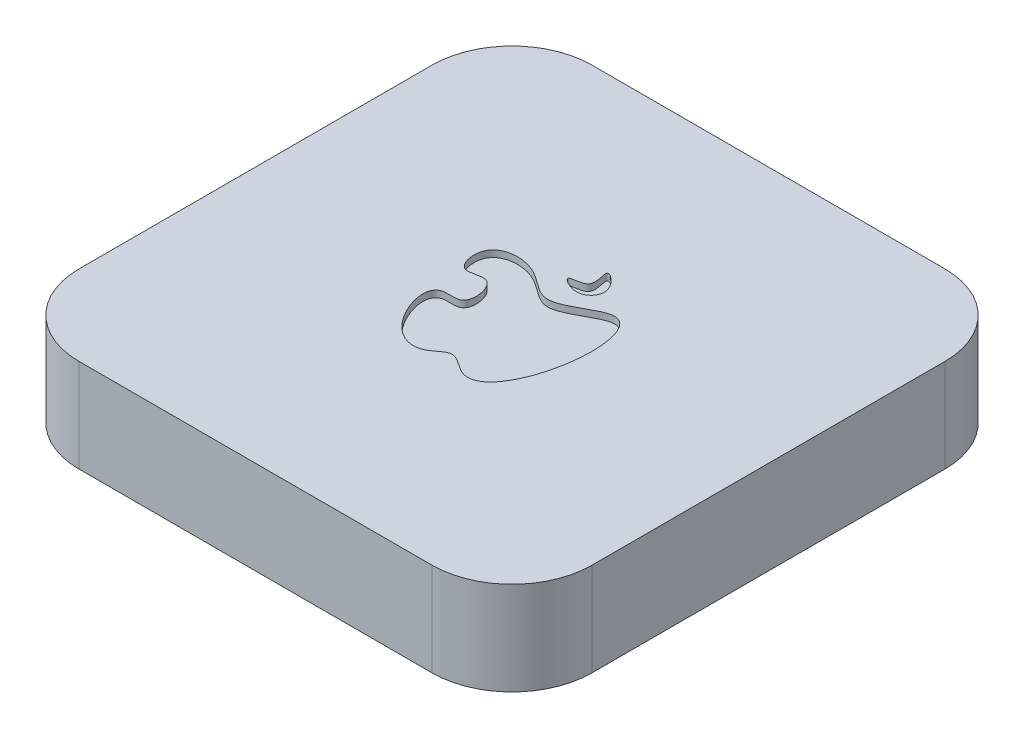
ISO-10303-21;
HEADER;
FILE_DESCRIPTION(('STEP AP214'),'2;1');
FILE_NAME('part.step','',(''),(''),'','','');
FILE_SCHEMA(('AUTOMOTIVE_DESIGN { 1 0 10303 214 1 1 1 1 }'));
ENDSEC;
DATA;
#1=APPLICATION_CONTEXT('core data for automotive mechanical design processes');
#2=APPLICATION_PROTOCOL_DEFINITION('international standard','automotive_design',2000,#1);
#3=PRODUCT_CONTEXT('',#1,'mechanical');
#4=PRODUCT('Part','Part','',(#3));
#5=PRODUCT_RELATED_PRODUCT_CATEGORY('part','',(#4));
#6=PRODUCT_DEFINITION_FORMATION('','',#4);
#7=PRODUCT_DEFINITION_CONTEXT('part definition',#1,'design');
#8=PRODUCT_DEFINITION('design','',#6,#7);
#9=PRODUCT_DEFINITION_SHAPE('','',#8);
#10=(LENGTH_UNIT() NAMED_UNIT(*) SI_UNIT(.MILLI.,.METRE.));
#11=(NAMED_UNIT(*) PLANE_ANGLE_UNIT() SI_UNIT($,.RADIAN.));
#12=(NAMED_UNIT(*) SI_UNIT($,.STERADIAN.) SOLID_ANGLE_UNIT());
#13=UNCERTAINTY_MEASURE_WITH_UNIT(LENGTH_MEASURE(1.E-05),#10,'distance_accuracy_value','');
#14=(GEOMETRIC_REPRESENTATION_CONTEXT(3) GLOBAL_UNCERTAINTY_ASSIGNED_CONTEXT((#13)) GLOBAL_UNIT_ASSIGNED_CONTEXT((#10,
#11,#12)) REPRESENTATION_CONTEXT('',''));
#15=CARTESIAN_POINT('',(0.,0.,0.));
#16=DIRECTION('',(0.,0.,1.));
#17=DIRECTION('',(1.,0.,0.));
#18=AXIS2_PLACEMENT_3D('',#15,#16,#17);
#19=CARTESIAN_POINT('',(67.31,35.56,-67.31));
#20=DIRECTION('',(0.,-1.,0.));
#21=DIRECTION('',(0.,0.,-1.));
#22=AXIS2_PLACEMENT_3D('',#19,#20,#21);
#23=CYLINDRICAL_SURFACE('',#22,30.48);
#24=CARTESIAN_POINT('',(67.31,0.,-67.31));
#25=DIRECTION('',(0.,1.,0.));
#26=DIRECTION('',(0.,0.,-1.));
#27=AXIS2_PLACEMENT_3D('',#24,#25,#26);
#28=CIRCLE('',#27,30.48);
#29=CARTESIAN_POINT('',(97.79,0.,-67.31));
#30=VERTEX_POINT('',#29);
#31=CARTESIAN_POINT('',(67.31,0.,-97.79));
#32=VERTEX_POINT('',#31);
#33=EDGE_CURVE('E128',#30,#32,#28,.T.);
#34=ORIENTED_EDGE('',*,*,#33,.T.);
#35=DIRECTION('',(0.,-1.,0.));
#36=VECTOR('',#35,1.);
#37=CARTESIAN_POINT('',(67.31,35.56,-97.79));
#38=LINE('',#37,#36);
#39=CARTESIAN_POINT('',(67.31,35.56,-97.79));
#40=VERTEX_POINT('',#39);
#41=EDGE_CURVE('E11',#40,#32,#38,.T.);
#42=ORIENTED_EDGE('',*,*,#41,.F.);
#43=CARTESIAN_POINT('',(67.31,35.56,-67.31));
#44=DIRECTION('',(0.,1.,0.));
#45=DIRECTION('',(0.,0.,-1.));
#46=AXIS2_PLACEMENT_3D('',#43,#44,#45);
#47=CIRCLE('',#46,30.48);
#48=CARTESIAN_POINT('',(97.79,35.56,-67.31));
#49=VERTEX_POINT('',#48);
#50=EDGE_CURVE('E143',#49,#40,#47,.T.);
#51=ORIENTED_EDGE('',*,*,#50,.F.);
#52=DIRECTION('',(0.,-1.,0.));
#53=VECTOR('',#52,1.);
#54=CARTESIAN_POINT('',(97.79,35.56,-67.31));
#55=LINE('',#54,#53);
#56=EDGE_CURVE('E124',#49,#30,#55,.T.);
#57=ORIENTED_EDGE('',*,*,#56,.T.);
#58=EDGE_LOOP('',(#34,#42,#51,#57));
#59=FACE_BOUND('',#58,.T.);
#60=ADVANCED_FACE('F32',(#59),#23,.T.);
#61=CARTESIAN_POINT('',(-67.31,35.56,-97.79));
#62=DIRECTION('',(0.,0.,1.));
#63=DIRECTION('',(1.,0.,0.));
#64=AXIS2_PLACEMENT_3D('',#61,#62,#63);
#65=PLANE('',#64);
#66=DIRECTION('',(-1.,0.,0.));
#67=VECTOR('',#66,1.);
#68=CARTESIAN_POINT('',(-67.31,0.,-97.79));
#69=LINE('',#68,#67);
#70=CARTESIAN_POINT('',(-67.31,0.,-97.79));
#71=VERTEX_POINT('',#70);
#72=EDGE_CURVE('E131',#32,#71,#69,.T.);
#73=ORIENTED_EDGE('',*,*,#72,.T.);
#74=DIRECTION('',(0.,-1.,0.));
#75=VECTOR('',#74,1.);
#76=CARTESIAN_POINT('',(-67.31,35.56,-97.79));
#77=LINE('',#76,#75);
#78=CARTESIAN_POINT('',(-67.31,35.56,-97.79));
#79=VERTEX_POINT('',#78);
#80=EDGE_CURVE('E40',#79,#71,#77,.T.);
#81=ORIENTED_EDGE('',*,*,#80,.F.);
#82=DIRECTION('',(-1.,0.,0.));
#83=VECTOR('',#82,1.);
#84=CARTESIAN_POINT('',(-67.31,35.56,-97.79));
#85=LINE('',#84,#83);
#86=EDGE_CURVE('E91',#40,#79,#85,.T.);
#87=ORIENTED_EDGE('',*,*,#86,.F.);
#88=ORIENTED_EDGE('',*,*,#41,.T.);
#89=EDGE_LOOP('',(#73,#81,#87,#88));
#90=FACE_BOUND('',#89,.T.);
#91=ADVANCED_FACE('F222',(#90),#65,.F.);
#92=CARTESIAN_POINT('',(-67.31,35.56,-67.31));
#93=DIRECTION('',(0.,-1.,0.));
#94=DIRECTION('',(0.,0.,-1.));
#95=AXIS2_PLACEMENT_3D('',#92,#93,#94);
#96=CYLINDRICAL_SURFACE('',#95,30.48);
#97=CARTESIAN_POINT('',(-67.31,0.,-67.31));
#98=DIRECTION('',(0.,1.,0.));
#99=DIRECTION('',(0.,0.,-1.));
#100=AXIS2_PLACEMENT_3D('',#97,#98,#99);
#101=CIRCLE('',#100,30.48);
#102=CARTESIAN_POINT('',(-97.79,0.,-67.31));
#103=VERTEX_POINT('',#102);
#104=EDGE_CURVE('E134',#71,#103,#101,.T.);
#105=ORIENTED_EDGE('',*,*,#104,.T.);
#106=DIRECTION('',(0.,-1.,0.));
#107=VECTOR('',#106,1.);
#108=CARTESIAN_POINT('',(-97.79,35.56,-67.31));
#109=LINE('',#108,#107);
#110=CARTESIAN_POINT('',(-97.79,35.56,-67.31));
#111=VERTEX_POINT('',#110);
#112=EDGE_CURVE('E150',#111,#103,#109,.T.);
#113=ORIENTED_EDGE('',*,*,#112,.F.);
#114=CARTESIAN_POINT('',(-67.31,35.56,-67.31));
#115=DIRECTION('',(0.,1.,0.));
#116=DIRECTION('',(0.,0.,-1.));
#117=AXIS2_PLACEMENT_3D('',#114,#115,#116);
#118=CIRCLE('',#117,30.48);
#119=EDGE_CURVE('E158',#79,#111,#118,.T.);
#120=ORIENTED_EDGE('',*,*,#119,.F.);
#121=ORIENTED_EDGE('',*,*,#80,.T.);
#122=EDGE_LOOP('',(#105,#113,#120,#121));
#123=FACE_BOUND('',#122,.T.);
#124=ADVANCED_FACE('F156',(#123),#96,.T.);
#125=CARTESIAN_POINT('',(-97.79,35.56,67.31));
#126=DIRECTION('',(1.,0.,0.));
#127=DIRECTION('',(0.,0.,-1.));
#128=AXIS2_PLACEMENT_3D('',#125,#126,#127);
#129=PLANE('',#128);
#130=DIRECTION('',(0.,0.,1.));
#131=VECTOR('',#130,1.);
#132=CARTESIAN_POINT('',(-97.79,0.,67.31));
#133=LINE('',#132,#131);
#134=CARTESIAN_POINT('',(-97.79,0.,67.31));
#135=VERTEX_POINT('',#134);
#136=EDGE_CURVE('E136',#103,#135,#133,.T.);
#137=ORIENTED_EDGE('',*,*,#136,.T.);
#138=DIRECTION('',(0.,-1.,0.));
#139=VECTOR('',#138,1.);
#140=CARTESIAN_POINT('',(-97.79,35.56,67.31));
#141=LINE('',#140,#139);
#142=CARTESIAN_POINT('',(-97.79,35.56,67.31));
#143=VERTEX_POINT('',#142);
#144=EDGE_CURVE('E147',#143,#135,#141,.T.);
#145=ORIENTED_EDGE('',*,*,#144,.F.);
#146=DIRECTION('',(0.,0.,1.));
#147=VECTOR('',#146,1.);
#148=CARTESIAN_POINT('',(-97.79,35.56,67.31));
#149=LINE('',#148,#147);
#150=EDGE_CURVE('E170',#111,#143,#149,.T.);
#151=ORIENTED_EDGE('',*,*,#150,.F.);
#152=ORIENTED_EDGE('',*,*,#112,.T.);
#153=EDGE_LOOP('',(#137,#145,#151,#152));
#154=FACE_BOUND('',#153,.T.);
#155=ADVANCED_FACE('F166',(#154),#129,.F.);
#156=CARTESIAN_POINT('',(-67.31,35.56,67.31));
#157=DIRECTION('',(0.,-1.,0.));
#158=DIRECTION('',(0.,0.,-1.));
#159=AXIS2_PLACEMENT_3D('',#156,#157,#158);
#160=CYLINDRICAL_SURFACE('',#159,30.48);
#161=CARTESIAN_POINT('',(-67.31,0.,67.31));
#162=DIRECTION('',(0.,1.,0.));
#163=DIRECTION('',(0.,0.,-1.));
#164=AXIS2_PLACEMENT_3D('',#161,#162,#163);
#165=CIRCLE('',#164,30.48);
#166=CARTESIAN_POINT('',(-67.31,0.,97.79));
#167=VERTEX_POINT('',#166);
#168=EDGE_CURVE('E138',#135,#167,#165,.T.);
#169=ORIENTED_EDGE('',*,*,#168,.T.);
#170=DIRECTION('',(0.,-1.,0.));
#171=VECTOR('',#170,1.);
#172=CARTESIAN_POINT('',(-67.31,35.56,97.79));
#173=LINE('',#172,#171);
#174=CARTESIAN_POINT('',(-67.31,35.56,97.79));
#175=VERTEX_POINT('',#174);
#176=EDGE_CURVE('E119',#175,#167,#173,.T.);
#177=ORIENTED_EDGE('',*,*,#176,.F.);
#178=CARTESIAN_POINT('',(-67.31,35.56,67.31));
#179=DIRECTION('',(0.,1.,0.));
#180=DIRECTION('',(0.,0.,-1.));
#181=AXIS2_PLACEMENT_3D('',#178,#179,#180);
#182=CIRCLE('',#181,30.48);
#183=EDGE_CURVE('E110',#143,#175,#182,.T.);
#184=ORIENTED_EDGE('',*,*,#183,.F.);
#185=ORIENTED_EDGE('',*,*,#144,.T.);
#186=EDGE_LOOP('',(#169,#177,#184,#185));
#187=FACE_BOUND('',#186,.T.);
#188=ADVANCED_FACE('F169',(#187),#160,.T.);
#189=CARTESIAN_POINT('',(-67.31,35.56,97.79));
#190=DIRECTION('',(0.,0.,-1.));
#191=DIRECTION('',(-1.,0.,0.));
#192=AXIS2_PLACEMENT_3D('',#189,#190,#191);
#193=PLANE('',#192);
#194=DIRECTION('',(1.,0.,0.));
#195=VECTOR('',#194,1.);
#196=CARTESIAN_POINT('',(-67.31,0.,97.79));
#197=LINE('',#196,#195);
#198=CARTESIAN_POINT('',(67.31,0.,97.79));
#199=VERTEX_POINT('',#198);
#200=EDGE_CURVE('E118',#167,#199,#197,.T.);
#201=ORIENTED_EDGE('',*,*,#200,.T.);
#202=DIRECTION('',(0.,-1.,0.));
#203=VECTOR('',#202,1.);
#204=CARTESIAN_POINT('',(67.31,35.56,97.79));
#205=LINE('',#204,#203);
#206=CARTESIAN_POINT('',(67.31,35.56,97.79));
#207=VERTEX_POINT('',#206);
#208=EDGE_CURVE('E115',#207,#199,#205,.T.);
#209=ORIENTED_EDGE('',*,*,#208,.F.);
#210=DIRECTION('',(1.,0.,0.));
#211=VECTOR('',#210,1.);
#212=CARTESIAN_POINT('',(-67.31,35.56,97.79));
#213=LINE('',#212,#211);
#214=EDGE_CURVE('E104',#175,#207,#213,.T.);
#215=ORIENTED_EDGE('',*,*,#214,.F.);
#216=ORIENTED_EDGE('',*,*,#176,.T.);
#217=EDGE_LOOP('',(#201,#209,#215,#216));
#218=FACE_BOUND('',#217,.T.);
#219=ADVANCED_FACE('F116',(#218),#193,.F.);
#220=CARTESIAN_POINT('',(67.31,35.56,67.31));
#221=DIRECTION('',(0.,-1.,0.));
#222=DIRECTION('',(0.,0.,-1.));
#223=AXIS2_PLACEMENT_3D('',#220,#221,#222);
#224=CYLINDRICAL_SURFACE('',#223,30.48);
#225=CARTESIAN_POINT('',(67.31,0.,67.31));
#226=DIRECTION('',(0.,1.,0.));
#227=DIRECTION('',(0.,0.,-1.));
#228=AXIS2_PLACEMENT_3D('',#225,#226,#227);
#229=CIRCLE('',#228,30.48);
#230=CARTESIAN_POINT('',(97.79,0.,67.31));
#231=VERTEX_POINT('',#230);
#232=EDGE_CURVE('E77',#199,#231,#229,.T.);
#233=ORIENTED_EDGE('',*,*,#232,.T.);
#234=DIRECTION('',(0.,-1.,0.));
#235=VECTOR('',#234,1.);
#236=CARTESIAN_POINT('',(97.79,35.56,67.31));
#237=LINE('',#236,#235);
#238=CARTESIAN_POINT('',(97.79,35.56,67.31));
#239=VERTEX_POINT('',#238);
#240=EDGE_CURVE('E120',#239,#231,#237,.T.);
#241=ORIENTED_EDGE('',*,*,#240,.F.);
#242=CARTESIAN_POINT('',(67.31,35.56,67.31));
#243=DIRECTION('',(0.,1.,0.));
#244=DIRECTION('',(0.,0.,-1.));
#245=AXIS2_PLACEMENT_3D('',#242,#243,#244);
#246=CIRCLE('',#245,30.48);
#247=EDGE_CURVE('E108',#207,#239,#246,.T.);
#248=ORIENTED_EDGE('',*,*,#247,.F.);
#249=ORIENTED_EDGE('',*,*,#208,.T.);
#250=EDGE_LOOP('',(#233,#241,#248,#249));
#251=FACE_BOUND('',#250,.T.);
#252=ADVANCED_FACE('F122',(#251),#224,.T.);
#253=CARTESIAN_POINT('',(97.79,35.56,67.31));
#254=DIRECTION('',(-1.,0.,0.));
#255=DIRECTION('',(0.,0.,1.));
#256=AXIS2_PLACEMENT_3D('',#253,#254,#255);
#257=PLANE('',#256);
#258=DIRECTION('',(0.,0.,-1.));
#259=VECTOR('',#258,1.);
#260=CARTESIAN_POINT('',(97.79,0.,67.31));
#261=LINE('',#260,#259);
#262=EDGE_CURVE('E83',#231,#30,#261,.T.);
#263=ORIENTED_EDGE('',*,*,#262,.T.);
#264=ORIENTED_EDGE('',*,*,#56,.F.);
#265=DIRECTION('',(0.,0.,-1.));
#266=VECTOR('',#265,1.);
#267=CARTESIAN_POINT('',(97.79,35.56,67.31));
#268=LINE('',#267,#266);
#269=EDGE_CURVE('E48',#239,#49,#268,.T.);
#270=ORIENTED_EDGE('',*,*,#269,.F.);
#271=ORIENTED_EDGE('',*,*,#240,.T.);
#272=EDGE_LOOP('',(#263,#264,#270,#271));
#273=FACE_BOUND('',#272,.T.);
#274=ADVANCED_FACE('F207',(#273),#257,.F.);
#275=CARTESIAN_POINT('',(67.31,35.56,-67.31));
#276=DIRECTION('',(0.,-1.,0.));
#277=DIRECTION('',(0.,0.,-1.));
#278=AXIS2_PLACEMENT_3D('',#275,#276,#277);
#279=PLANE('',#278);
#280=CARTESIAN_POINT('',(4.288165984766,35.56,-31.9685717533366));
#281=CARTESIAN_POINT('',(3.67978901099992,35.56,-31.0998397492274));
#282=CARTESIAN_POINT('',(7.58361797705248,35.56,-23.0148130458734));
#283=CARTESIAN_POINT('',(-5.16335585684933,35.56,-24.0840909320977));
#284=CARTESIAN_POINT('',(5.97608866841104,35.56,-17.4683384723268));
#285=CARTESIAN_POINT('',(13.30281744939,35.56,-26.0545517085606));
#286=CARTESIAN_POINT('',(4.95987578333676,35.56,-32.9277398754958));
#287=CARTESIAN_POINT('',(4.288165984766,35.56,-31.9685717533366));
#288=B_SPLINE_CURVE_WITH_KNOTS('',3,(#280,#281,#282,#283,#284,#285,#286,#287),.UNSPECIFIED.,.T.,
.F.,(4,1,1,1,1,4),(0.,0.195830992323339,0.365222462538927,0.545054385667901,0.783782749710053,
1.),.UNSPECIFIED.);
#289=CARTESIAN_POINT('',(4.288165984766,35.56,-31.9685717533366));
#290=VERTEX_POINT('',#289);
#291=EDGE_CURVE('E190',#290,#290,#288,.T.);
#292=ORIENTED_EDGE('',*,*,#291,.F.);
#293=EDGE_LOOP('',(#292));
#294=FACE_BOUND('',#293,.T.);
#295=CARTESIAN_POINT('',(1.06915926308203,35.56,-12.0539573515623));
#296=CARTESIAN_POINT('',(-3.3633623481675,35.56,-12.3728042785817));
#297=CARTESIAN_POINT('',(-10.125556887263,35.56,-21.7962306147753));
#298=CARTESIAN_POINT('',(-29.5077310328441,35.56,-20.4211358251429));
#299=CARTESIAN_POINT('',(-25.9144559384808,35.56,-3.07297460753987));
#300=CARTESIAN_POINT('',(-14.0441401543561,35.56,-10.3996076539923));
#301=CARTESIAN_POINT('',(-10.9022608053611,35.56,7.05832017466993));
#302=CARTESIAN_POINT('',(-28.2677466750073,35.56,2.50171490096931));
#303=CARTESIAN_POINT('',(-20.6584011280455,35.56,26.8464839937777));
#304=CARTESIAN_POINT('',(-6.04057661258619,35.56,30.6126351141355));
#305=CARTESIAN_POINT('',(1.53077027456296,35.56,21.8352959101032));
#306=CARTESIAN_POINT('',(15.0267598270354,35.56,36.1094980049391));
#307=CARTESIAN_POINT('',(30.4910313379379,35.56,7.91698809450731));
#308=CARTESIAN_POINT('',(25.3108628436966,35.56,-29.2341777672177));
#309=CARTESIAN_POINT('',(7.02690029516023,35.56,-11.62539600733));
#310=CARTESIAN_POINT('',(1.06915926308203,35.56,-12.0539573515623));
#311=B_SPLINE_CURVE_WITH_KNOTS('',3,(#295,#296,#297,#298,#299,#300,#301,#302,#303,#304,#305,
#306,#307,#308,#309,#310),.UNSPECIFIED.,.T.,.F.,(4,1,1,1,1,1,1,1,1,1,1,1,1,4),(0.,
0.0798113251085476,0.158965448280476,0.211414536634463,0.25097874301615,0.311195319599414,
0.346714689064737,0.453287258936834,0.521051439820928,0.556601871812459,0.604019741656839,
0.74956585814249,0.892725800768361,1.),.UNSPECIFIED.);
#312=CARTESIAN_POINT('',(1.06915926308203,35.56,-12.0539573515623));
#313=VERTEX_POINT('',#312);
#314=EDGE_CURVE('E176',#313,#313,#311,.T.);
#315=ORIENTED_EDGE('',*,*,#314,.F.);
#316=EDGE_LOOP('',(#315));
#317=FACE_BOUND('',#316,.T.);
#318=ORIENTED_EDGE('',*,*,#50,.T.);
#319=ORIENTED_EDGE('',*,*,#86,.T.);
#320=ORIENTED_EDGE('',*,*,#119,.T.);
#321=ORIENTED_EDGE('',*,*,#150,.T.);
#322=ORIENTED_EDGE('',*,*,#183,.T.);
#323=ORIENTED_EDGE('',*,*,#214,.T.);
#324=ORIENTED_EDGE('',*,*,#247,.T.);
#325=ORIENTED_EDGE('',*,*,#269,.T.);
#326=EDGE_LOOP('',(#318,#319,#320,#321,#322,#323,#324,#325));
#327=FACE_BOUND('',#326,.T.);
#328=ADVANCED_FACE('F106',(#294,#317,#327),#279,.F.);
#329=CARTESIAN_POINT('',(67.31,0.,-67.31));
#330=DIRECTION('',(0.,-1.,0.));
#331=DIRECTION('',(0.,0.,-1.));
#332=AXIS2_PLACEMENT_3D('',#329,#330,#331);
#333=PLANE('',#332);
#334=ORIENTED_EDGE('',*,*,#33,.F.);
#335=ORIENTED_EDGE('',*,*,#262,.F.);
#336=ORIENTED_EDGE('',*,*,#232,.F.);
#337=ORIENTED_EDGE('',*,*,#200,.F.);
#338=ORIENTED_EDGE('',*,*,#168,.F.);
#339=ORIENTED_EDGE('',*,*,#136,.F.);
#340=ORIENTED_EDGE('',*,*,#104,.F.);
#341=ORIENTED_EDGE('',*,*,#72,.F.);
#342=EDGE_LOOP('',(#334,#335,#336,#337,#338,#339,#340,#341));
#343=FACE_BOUND('',#342,.T.);
#344=ADVANCED_FACE('F162',(#343),#333,.T.);
#345=CARTESIAN_POINT('',(1.06915926308203,33.02,-12.0539573515623));
#346=CARTESIAN_POINT('',(-3.3633623481675,33.02,-12.3728042785817));
#347=CARTESIAN_POINT('',(-10.125556887263,33.02,-21.7962306147753));
#348=CARTESIAN_POINT('',(-29.5077310328441,33.02,-20.4211358251429));
#349=CARTESIAN_POINT('',(-25.9144559384808,33.02,-3.07297460753987));
#350=CARTESIAN_POINT('',(-14.0441401543561,33.02,-10.3996076539923));
#351=CARTESIAN_POINT('',(-10.9022608053611,33.02,7.05832017466993));
#352=CARTESIAN_POINT('',(-28.2677466750073,33.02,2.50171490096931));
#353=CARTESIAN_POINT('',(-20.6584011280455,33.02,26.8464839937777));
#354=CARTESIAN_POINT('',(-6.04057661258619,33.02,30.6126351141355));
#355=CARTESIAN_POINT('',(1.53077027456296,33.02,21.8352959101032));
#356=CARTESIAN_POINT('',(15.0267598270354,33.02,36.1094980049391));
#357=CARTESIAN_POINT('',(30.4910313379379,33.02,7.91698809450731));
#358=CARTESIAN_POINT('',(25.3108628436966,33.02,-29.2341777672177));
#359=CARTESIAN_POINT('',(7.02690029516023,33.02,-11.62539600733));
#360=CARTESIAN_POINT('',(1.06915926308203,33.02,-12.0539573515623));
#361=B_SPLINE_CURVE_WITH_KNOTS('',3,(#345,#346,#347,#348,#349,#350,#351,#352,#353,#354,#355,
#356,#357,#358,#359,#360),.UNSPECIFIED.,.T.,.F.,(4,1,1,1,1,1,1,1,1,1,1,1,1,4),(0.,
0.0798113251085476,0.158965448280476,0.211414536634463,0.25097874301615,0.311195319599414,
0.346714689064737,0.453287258936834,0.521051439820928,0.556601871812459,0.604019741656839,
0.74956585814249,0.892725800768361,1.),.UNSPECIFIED.);
#362=DIRECTION('',(0.,1.,0.));
#363=VECTOR('',#362,1.);
#364=SURFACE_OF_LINEAR_EXTRUSION('',#361,#363);
#365=CARTESIAN_POINT('',(1.06915926308203,33.02,-12.0539573515623));
#366=VERTEX_POINT('',#365);
#367=EDGE_CURVE('E132',#366,#366,#361,.T.);
#368=ORIENTED_EDGE('',*,*,#367,.F.);
#369=EDGE_LOOP('',(#368));
#370=FACE_BOUND('',#369,.T.);
#371=ORIENTED_EDGE('',*,*,#314,.T.);
#372=EDGE_LOOP('',(#371));
#373=FACE_BOUND('',#372,.T.);
#374=ADVANCED_FACE('F198',(#370,#373),#364,.F.);
#375=CARTESIAN_POINT('',(-8.45178400164092,33.02,28.8709445964874));
#376=DIRECTION('',(0.,-1.,0.));
#377=DIRECTION('',(0.,0.,-1.));
#378=AXIS2_PLACEMENT_3D('',#375,#376,#377);
#379=PLANE('',#378);
#380=ORIENTED_EDGE('',*,*,#367,.T.);
#381=EDGE_LOOP('',(#380));
#382=FACE_BOUND('',#381,.T.);
#383=ADVANCED_FACE('F202',(#382),#379,.F.);
#384=CARTESIAN_POINT('',(4.288165984766,33.02,-31.9685717533366));
#385=CARTESIAN_POINT('',(3.67978901099992,33.02,-31.0998397492274));
#386=CARTESIAN_POINT('',(7.58361797705248,33.02,-23.0148130458734));
#387=CARTESIAN_POINT('',(-5.16335585684933,33.02,-24.0840909320977));
#388=CARTESIAN_POINT('',(5.97608866841104,33.02,-17.4683384723268));
#389=CARTESIAN_POINT('',(13.30281744939,33.02,-26.0545517085606));
#390=CARTESIAN_POINT('',(4.95987578333676,33.02,-32.9277398754958));
#391=CARTESIAN_POINT('',(4.288165984766,33.02,-31.9685717533366));
#392=B_SPLINE_CURVE_WITH_KNOTS('',3,(#384,#385,#386,#387,#388,#389,#390,#391),.UNSPECIFIED.,.T.,
.F.,(4,1,1,1,1,4),(0.,0.195830992323339,0.365222462538927,0.545054385667901,0.783782749710053,
1.),.UNSPECIFIED.);
#393=DIRECTION('',(0.,1.,0.));
#394=VECTOR('',#393,1.);
#395=SURFACE_OF_LINEAR_EXTRUSION('',#392,#394);
#396=CARTESIAN_POINT('',(4.288165984766,33.02,-31.9685717533366));
#397=VERTEX_POINT('',#396);
#398=EDGE_CURVE('E181',#397,#397,#392,.T.);
#399=ORIENTED_EDGE('',*,*,#398,.F.);
#400=EDGE_LOOP('',(#399));
#401=FACE_BOUND('',#400,.T.);
#402=ORIENTED_EDGE('',*,*,#291,.T.);
#403=EDGE_LOOP('',(#402));
#404=FACE_BOUND('',#403,.T.);
#405=ADVANCED_FACE('F299',(#401,#404),#395,.F.);
#406=CARTESIAN_POINT('',(2.12022639020621,33.02,-20.4386346384209));
#407=DIRECTION('',(0.,1.,0.));
#408=DIRECTION('',(0.,0.,1.));
#409=AXIS2_PLACEMENT_3D('',#406,#407,#408);
#410=PLANE('',#409);
#411=ORIENTED_EDGE('',*,*,#398,.T.);
#412=EDGE_LOOP('',(#411));
#413=FACE_BOUND('',#412,.T.);
#414=ADVANCED_FACE('F308',(#413),#410,.T.);
#415=CLOSED_SHELL('',(#60,#91,#124,#155,#188,#219,#252,#274,#328,#344,#374,#383,#405,#414));
#416=MANIFOLD_SOLID_BREP('B2',#415);
#417=ADVANCED_BREP_SHAPE_REPRESENTATION('',(#18,#416),#14);
#418=SHAPE_DEFINITION_REPRESENTATION(#9,#417);
ENDSEC;
END-ISO-10303-21;
